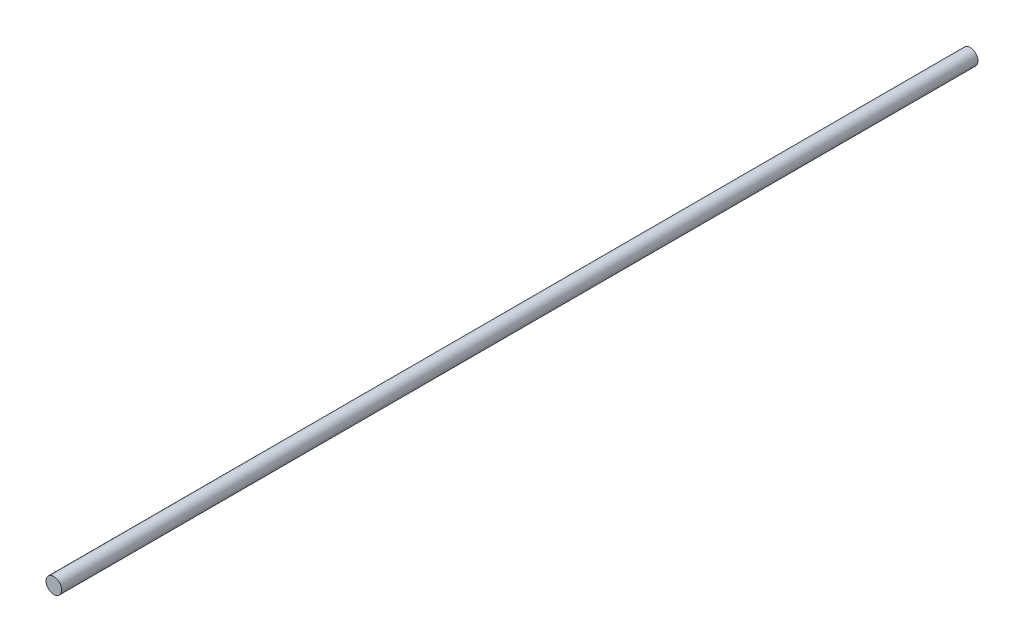
ISO-10303-21;
HEADER;
FILE_DESCRIPTION(('STEP AP214'),'2;1');
FILE_NAME('part.step','',(''),(''),'','','');
FILE_SCHEMA(('AUTOMOTIVE_DESIGN { 1 0 10303 214 1 1 1 1 }'));
ENDSEC;
DATA;
#1=APPLICATION_CONTEXT('core data for automotive mechanical design processes');
#2=APPLICATION_PROTOCOL_DEFINITION('international standard','automotive_design',2000,#1);
#3=PRODUCT_CONTEXT('',#1,'mechanical');
#4=PRODUCT('Part','Part','',(#3));
#5=PRODUCT_RELATED_PRODUCT_CATEGORY('part','',(#4));
#6=PRODUCT_DEFINITION_FORMATION('','',#4);
#7=PRODUCT_DEFINITION_CONTEXT('part definition',#1,'design');
#8=PRODUCT_DEFINITION('design','',#6,#7);
#9=PRODUCT_DEFINITION_SHAPE('','',#8);
#10=(LENGTH_UNIT() NAMED_UNIT(*) SI_UNIT(.MILLI.,.METRE.));
#11=(NAMED_UNIT(*) PLANE_ANGLE_UNIT() SI_UNIT($,.RADIAN.));
#12=(NAMED_UNIT(*) SI_UNIT($,.STERADIAN.) SOLID_ANGLE_UNIT());
#13=UNCERTAINTY_MEASURE_WITH_UNIT(LENGTH_MEASURE(1.E-05),#10,'distance_accuracy_value','');
#14=(GEOMETRIC_REPRESENTATION_CONTEXT(3) GLOBAL_UNCERTAINTY_ASSIGNED_CONTEXT((#13)) GLOBAL_UNIT_ASSIGNED_CONTEXT((#10,
#11,#12)) REPRESENTATION_CONTEXT('',''));
#15=CARTESIAN_POINT('',(0.,0.,0.));
#16=DIRECTION('',(0.,0.,1.));
#17=DIRECTION('',(1.,0.,0.));
#18=AXIS2_PLACEMENT_3D('',#15,#16,#17);
#19=CARTESIAN_POINT('',(-1.38461538461538,4.52884615384616,170.));
#20=DIRECTION('',(0.,0.,-1.));
#21=DIRECTION('',(-1.,0.,0.));
#22=AXIS2_PLACEMENT_3D('',#19,#20,#21);
#23=CYLINDRICAL_SURFACE('',#22,1.45);
#24=CARTESIAN_POINT('',(-1.38461538461538,4.52884615384616,170.));
#25=DIRECTION('',(0.,0.,1.));
#26=DIRECTION('',(1.,0.,0.));
#27=AXIS2_PLACEMENT_3D('',#24,#25,#26);
#28=CIRCLE('',#27,1.45);
#29=CARTESIAN_POINT('',(0.0653846153846162,4.52884615384616,170.));
#30=VERTEX_POINT('',#29);
#31=EDGE_CURVE('E10',#30,#30,#28,.T.);
#32=ORIENTED_EDGE('',*,*,#31,.F.);
#33=EDGE_LOOP('',(#32));
#34=FACE_BOUND('',#33,.T.);
#35=CARTESIAN_POINT('',(-1.38461538461538,4.52884615384616,0.));
#36=DIRECTION('',(0.,0.,1.));
#37=DIRECTION('',(1.,0.,0.));
#38=AXIS2_PLACEMENT_3D('',#35,#36,#37);
#39=CIRCLE('',#38,1.45);
#40=CARTESIAN_POINT('',(0.0653846153846162,4.52884615384616,0.));
#41=VERTEX_POINT('',#40);
#42=EDGE_CURVE('E44',#41,#41,#39,.T.);
#43=ORIENTED_EDGE('',*,*,#42,.T.);
#44=EDGE_LOOP('',(#43));
#45=FACE_BOUND('',#44,.T.);
#46=ADVANCED_FACE('F41',(#34,#45),#23,.T.);
#47=CARTESIAN_POINT('',(-1.38461538461538,4.52884615384616,170.));
#48=DIRECTION('',(0.,0.,1.));
#49=DIRECTION('',(1.,0.,0.));
#50=AXIS2_PLACEMENT_3D('',#47,#48,#49);
#51=PLANE('',#50);
#52=ORIENTED_EDGE('',*,*,#31,.T.);
#53=EDGE_LOOP('',(#52));
#54=FACE_BOUND('',#53,.T.);
#55=ADVANCED_FACE('F58',(#54),#51,.T.);
#56=CARTESIAN_POINT('',(-1.38461538461538,4.52884615384616,0.));
#57=DIRECTION('',(0.,0.,1.));
#58=DIRECTION('',(1.,0.,0.));
#59=AXIS2_PLACEMENT_3D('',#56,#57,#58);
#60=PLANE('',#59);
#61=ORIENTED_EDGE('',*,*,#42,.F.);
#62=EDGE_LOOP('',(#61));
#63=FACE_BOUND('',#62,.T.);
#64=ADVANCED_FACE('F56',(#63),#60,.F.);
#65=CLOSED_SHELL('',(#46,#55,#64));
#66=MANIFOLD_SOLID_BREP('B2',#65);
#67=ADVANCED_BREP_SHAPE_REPRESENTATION('',(#18,#66),#14);
#68=SHAPE_DEFINITION_REPRESENTATION(#9,#67);
ENDSEC;
END-ISO-10303-21;
